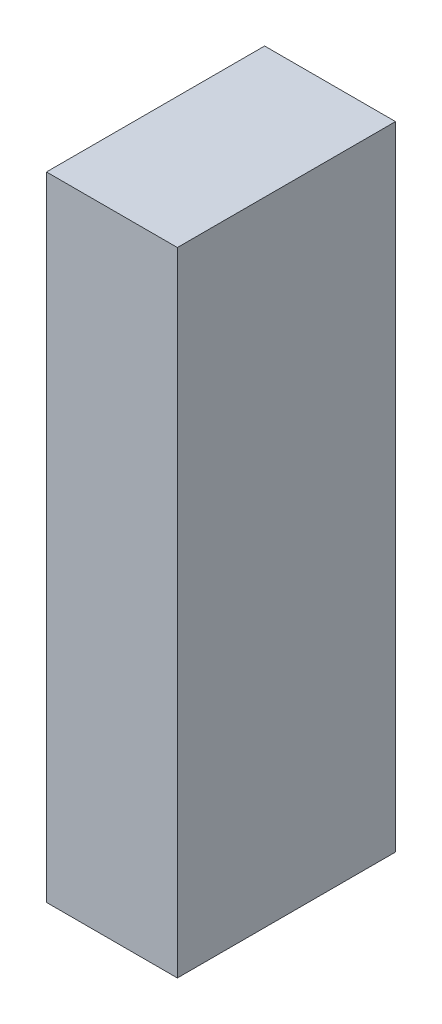
ISO-10303-21;
HEADER;
FILE_DESCRIPTION(('STEP AP214'),'2;1');
FILE_NAME('part.step','',(''),(''),'','','');
FILE_SCHEMA(('AUTOMOTIVE_DESIGN { 1 0 10303 214 1 1 1 1 }'));
ENDSEC;
DATA;
#1=APPLICATION_CONTEXT('core data for automotive mechanical design processes');
#2=APPLICATION_PROTOCOL_DEFINITION('international standard','automotive_design',2000,#1);
#3=PRODUCT_CONTEXT('',#1,'mechanical');
#4=PRODUCT('Part','Part','',(#3));
#5=PRODUCT_RELATED_PRODUCT_CATEGORY('part','',(#4));
#6=PRODUCT_DEFINITION_FORMATION('','',#4);
#7=PRODUCT_DEFINITION_CONTEXT('part definition',#1,'design');
#8=PRODUCT_DEFINITION('design','',#6,#7);
#9=PRODUCT_DEFINITION_SHAPE('','',#8);
#10=(LENGTH_UNIT() NAMED_UNIT(*) SI_UNIT(.MILLI.,.METRE.));
#11=(NAMED_UNIT(*) PLANE_ANGLE_UNIT() SI_UNIT($,.RADIAN.));
#12=(NAMED_UNIT(*) SI_UNIT($,.STERADIAN.) SOLID_ANGLE_UNIT());
#13=UNCERTAINTY_MEASURE_WITH_UNIT(LENGTH_MEASURE(1.E-05),#10,'distance_accuracy_value','');
#14=(GEOMETRIC_REPRESENTATION_CONTEXT(3) GLOBAL_UNCERTAINTY_ASSIGNED_CONTEXT((#13)) GLOBAL_UNIT_ASSIGNED_CONTEXT((#10,
#11,#12)) REPRESENTATION_CONTEXT('',''));
#15=CARTESIAN_POINT('',(0.,0.,0.));
#16=DIRECTION('',(0.,0.,1.));
#17=DIRECTION('',(1.,0.,0.));
#18=AXIS2_PLACEMENT_3D('',#15,#16,#17);
#19=CARTESIAN_POINT('',(-1.09998947570381,-0.724995158951316,-2.64111989736557));
#20=DIRECTION('',(-1.74845553146952E-07,-1.,0.));
#21=DIRECTION('',(1.,-1.74845553146952E-07,0.));
#22=AXIS2_PLACEMENT_3D('',#19,#20,#21);
#23=PLANE('',#22);
#24=DIRECTION('',(0.999999999999985,-1.74845553329084E-07,0.));
#25=VECTOR('',#24,1.);
#26=CARTESIAN_POINT('',(-1.09998947570381,-0.724995158951316,-2.64111989736557));
#27=LINE('',#26,#25);
#28=CARTESIAN_POINT('',(-1.09998947570381,-0.724995158951316,-2.64111989736557));
#29=VERTEX_POINT('',#28);
#30=CARTESIAN_POINT('',(-0.799971165156933,-0.724995211408185,-2.64111989736557));
#31=VERTEX_POINT('',#30);
#32=EDGE_CURVE('E11',#29,#31,#27,.T.);
#33=ORIENTED_EDGE('',*,*,#32,.T.);
#34=DIRECTION('',(0.,0.,1.));
#35=VECTOR('',#34,1.);
#36=CARTESIAN_POINT('',(-0.799971165156933,-0.724995211408183,-2.64111989736557));
#37=LINE('',#36,#35);
#38=CARTESIAN_POINT('',(-0.799971165156933,-0.724995211408185,-2.14112091064453));
#39=VERTEX_POINT('',#38);
#40=EDGE_CURVE('E88',#31,#39,#37,.T.);
#41=ORIENTED_EDGE('',*,*,#40,.T.);
#42=DIRECTION('',(0.999999999999985,-1.74845553329084E-07,0.));
#43=VECTOR('',#42,1.);
#44=CARTESIAN_POINT('',(-1.09998947570381,-0.724995158951316,-2.14112091064453));
#45=LINE('',#44,#43);
#46=CARTESIAN_POINT('',(-1.09998947570381,-0.724995158951316,-2.14112091064453));
#47=VERTEX_POINT('',#46);
#48=EDGE_CURVE('E83',#47,#39,#45,.T.);
#49=ORIENTED_EDGE('',*,*,#48,.F.);
#50=DIRECTION('',(0.,0.,1.));
#51=VECTOR('',#50,1.);
#52=CARTESIAN_POINT('',(-1.09998947570378,-0.724995158951316,-2.64111989736557));
#53=LINE('',#52,#51);
#54=EDGE_CURVE('E72',#29,#47,#53,.T.);
#55=ORIENTED_EDGE('',*,*,#54,.F.);
#56=EDGE_LOOP('',(#33,#41,#49,#55));
#57=FACE_BOUND('',#56,.T.);
#58=ADVANCED_FACE('F17',(#57),#23,.T.);
#59=CARTESIAN_POINT('',(-0.799971165156933,-0.724995211408185,-2.64111989736557));
#60=DIRECTION('',(1.,-1.74845553146952E-07,0.));
#61=DIRECTION('',(1.74845553146952E-07,1.,0.));
#62=AXIS2_PLACEMENT_3D('',#59,#60,#61);
#63=PLANE('',#62);
#64=DIRECTION('',(1.74845553118087E-07,0.999999999999985,0.));
#65=VECTOR('',#64,1.);
#66=CARTESIAN_POINT('',(-0.799971165156933,-0.724995211408185,-2.64111989736557));
#67=LINE('',#66,#65);
#68=CARTESIAN_POINT('',(-0.799970911630055,0.725009366228534,-2.64111989736557));
#69=VERTEX_POINT('',#68);
#70=EDGE_CURVE('E24',#31,#69,#67,.T.);
#71=ORIENTED_EDGE('',*,*,#70,.T.);
#72=DIRECTION('',(0.,0.,1.));
#73=VECTOR('',#72,1.);
#74=CARTESIAN_POINT('',(-0.79997091163008,0.725009366228534,-2.64111989736557));
#75=LINE('',#74,#73);
#76=CARTESIAN_POINT('',(-0.799970911630055,0.725009366228534,-2.14112091064453));
#77=VERTEX_POINT('',#76);
#78=EDGE_CURVE('E85',#69,#77,#75,.T.);
#79=ORIENTED_EDGE('',*,*,#78,.T.);
#80=DIRECTION('',(1.74845553118087E-07,0.999999999999985,0.));
#81=VECTOR('',#80,1.);
#82=CARTESIAN_POINT('',(-0.799971165156933,-0.724995211408185,-2.14112091064453));
#83=LINE('',#82,#81);
#84=EDGE_CURVE('E66',#39,#77,#83,.T.);
#85=ORIENTED_EDGE('',*,*,#84,.F.);
#86=ORIENTED_EDGE('',*,*,#40,.F.);
#87=EDGE_LOOP('',(#71,#79,#85,#86));
#88=FACE_BOUND('',#87,.T.);
#89=ADVANCED_FACE('F89',(#88),#63,.T.);
#90=CARTESIAN_POINT('',(-0.799970911630055,0.725009366228534,-2.64111989736557));
#91=DIRECTION('',(1.74845553146952E-07,1.,0.));
#92=DIRECTION('',(-1.,1.74845553146952E-07,0.));
#93=AXIS2_PLACEMENT_3D('',#90,#91,#92);
#94=PLANE('',#93);
#95=DIRECTION('',(-0.999999999999985,1.74845553329084E-07,0.));
#96=VECTOR('',#95,1.);
#97=CARTESIAN_POINT('',(-0.799970911630055,0.725009366228534,-2.64111989736557));
#98=LINE('',#97,#96);
#99=CARTESIAN_POINT('',(-1.09998922217693,0.725009418685403,-2.64111989736557));
#100=VERTEX_POINT('',#99);
#101=EDGE_CURVE('E62',#69,#100,#98,.T.);
#102=ORIENTED_EDGE('',*,*,#101,.T.);
#103=DIRECTION('',(0.,0.,1.));
#104=VECTOR('',#103,1.);
#105=CARTESIAN_POINT('',(-1.09998922217693,0.725009418685401,-2.64111989736557));
#106=LINE('',#105,#104);
#107=CARTESIAN_POINT('',(-1.09998922217693,0.725009418685403,-2.14112091064453));
#108=VERTEX_POINT('',#107);
#109=EDGE_CURVE('E55',#100,#108,#106,.T.);
#110=ORIENTED_EDGE('',*,*,#109,.T.);
#111=DIRECTION('',(-0.999999999999985,1.74845553329084E-07,0.));
#112=VECTOR('',#111,1.);
#113=CARTESIAN_POINT('',(-0.799970911630055,0.725009366228534,-2.14112091064453));
#114=LINE('',#113,#112);
#115=EDGE_CURVE('E59',#77,#108,#114,.T.);
#116=ORIENTED_EDGE('',*,*,#115,.F.);
#117=ORIENTED_EDGE('',*,*,#78,.F.);
#118=EDGE_LOOP('',(#102,#110,#116,#117));
#119=FACE_BOUND('',#118,.T.);
#120=ADVANCED_FACE('F57',(#119),#94,.T.);
#121=CARTESIAN_POINT('',(-1.09998922217693,0.725009418685403,-2.64111989736557));
#122=DIRECTION('',(-1.,1.74845553146952E-07,0.));
#123=DIRECTION('',(-1.74845553146952E-07,-1.,0.));
#124=AXIS2_PLACEMENT_3D('',#121,#122,#123);
#125=PLANE('',#124);
#126=DIRECTION('',(-1.74845553118087E-07,-0.999999999999985,0.));
#127=VECTOR('',#126,1.);
#128=CARTESIAN_POINT('',(-1.09998922217693,0.725009418685403,-2.64111989736557));
#129=LINE('',#128,#127);
#130=EDGE_CURVE('E65',#100,#29,#129,.T.);
#131=ORIENTED_EDGE('',*,*,#130,.T.);
#132=ORIENTED_EDGE('',*,*,#54,.T.);
#133=DIRECTION('',(-1.74845553118087E-07,-0.999999999999985,0.));
#134=VECTOR('',#133,1.);
#135=CARTESIAN_POINT('',(-1.09998922217693,0.725009418685403,-2.14112091064453));
#136=LINE('',#135,#134);
#137=EDGE_CURVE('E70',#108,#47,#136,.T.);
#138=ORIENTED_EDGE('',*,*,#137,.F.);
#139=ORIENTED_EDGE('',*,*,#109,.F.);
#140=EDGE_LOOP('',(#131,#132,#138,#139));
#141=FACE_BOUND('',#140,.T.);
#142=ADVANCED_FACE('F71',(#141),#125,.T.);
#143=CARTESIAN_POINT('',(-462.125,-95.8249130249023,-2.14112091064453));
#144=DIRECTION('',(0.,0.,1.));
#145=DIRECTION('',(1.,-1.74845553146952E-07,0.));
#146=AXIS2_PLACEMENT_3D('',#143,#144,#145);
#147=PLANE('',#146);
#148=ORIENTED_EDGE('',*,*,#48,.T.);
#149=ORIENTED_EDGE('',*,*,#84,.T.);
#150=ORIENTED_EDGE('',*,*,#115,.T.);
#151=ORIENTED_EDGE('',*,*,#137,.T.);
#152=EDGE_LOOP('',(#148,#149,#150,#151));
#153=FACE_BOUND('',#152,.T.);
#154=ADVANCED_FACE('F76',(#153),#147,.T.);
#155=CARTESIAN_POINT('',(-462.125,-95.8249130249023,-2.64111989736557));
#156=DIRECTION('',(0.,0.,1.));
#157=DIRECTION('',(1.,-1.74845553146952E-07,0.));
#158=AXIS2_PLACEMENT_3D('',#155,#156,#157);
#159=PLANE('',#158);
#160=ORIENTED_EDGE('',*,*,#130,.F.);
#161=ORIENTED_EDGE('',*,*,#101,.F.);
#162=ORIENTED_EDGE('',*,*,#70,.F.);
#163=ORIENTED_EDGE('',*,*,#32,.F.);
#164=EDGE_LOOP('',(#160,#161,#162,#163));
#165=FACE_BOUND('',#164,.T.);
#166=ADVANCED_FACE('F91',(#165),#159,.F.);
#167=CLOSED_SHELL('',(#58,#89,#120,#142,#154,#166));
#168=MANIFOLD_SOLID_BREP('B1',#167);
#169=ADVANCED_BREP_SHAPE_REPRESENTATION('',(#18,#168),#14);
#170=SHAPE_DEFINITION_REPRESENTATION(#9,#169);
ENDSEC;
END-ISO-10303-21;
